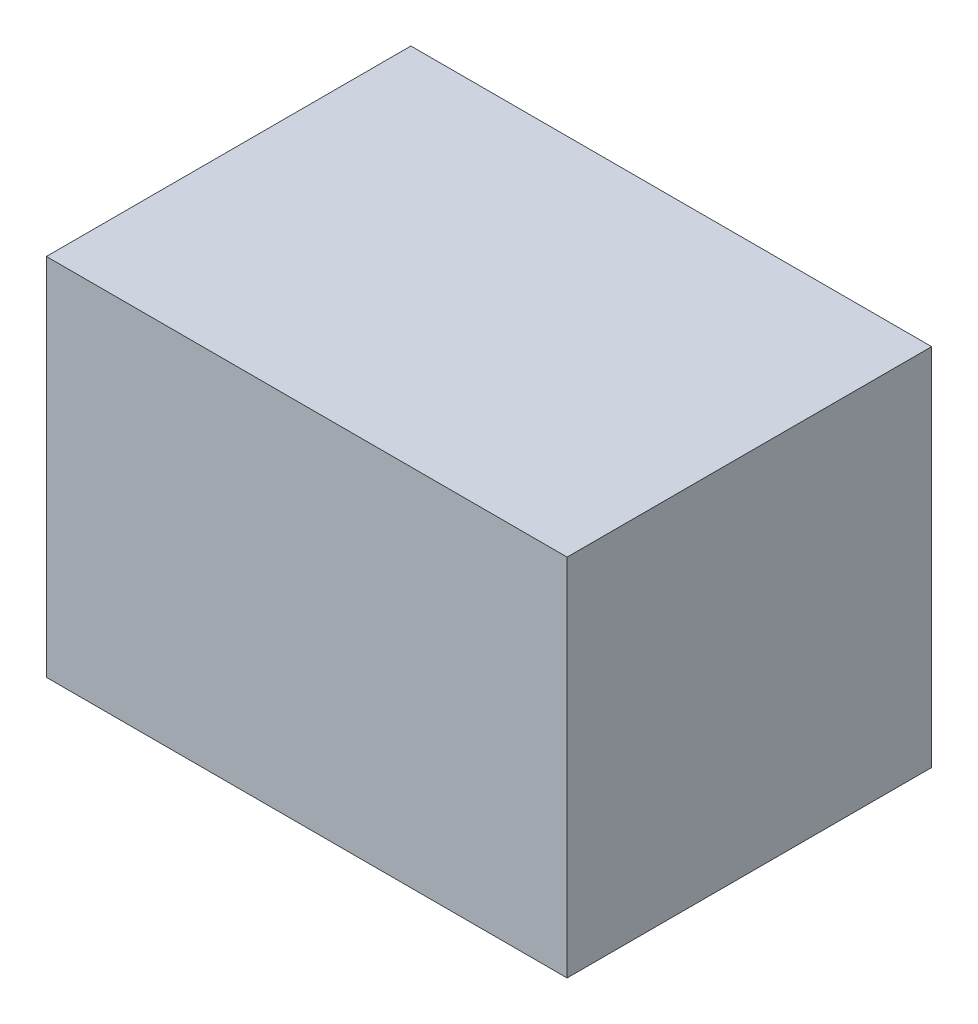
ISO-10303-21;
HEADER;
FILE_DESCRIPTION(('STEP AP214'),'2;1');
FILE_NAME('part.step','',(''),(''),'','','');
FILE_SCHEMA(('AUTOMOTIVE_DESIGN { 1 0 10303 214 1 1 1 1 }'));
ENDSEC;
DATA;
#1=APPLICATION_CONTEXT('core data for automotive mechanical design processes');
#2=APPLICATION_PROTOCOL_DEFINITION('international standard','automotive_design',2000,#1);
#3=PRODUCT_CONTEXT('',#1,'mechanical');
#4=PRODUCT('Part','Part','',(#3));
#5=PRODUCT_RELATED_PRODUCT_CATEGORY('part','',(#4));
#6=PRODUCT_DEFINITION_FORMATION('','',#4);
#7=PRODUCT_DEFINITION_CONTEXT('part definition',#1,'design');
#8=PRODUCT_DEFINITION('design','',#6,#7);
#9=PRODUCT_DEFINITION_SHAPE('','',#8);
#10=(LENGTH_UNIT() NAMED_UNIT(*) SI_UNIT(.MILLI.,.METRE.));
#11=(NAMED_UNIT(*) PLANE_ANGLE_UNIT() SI_UNIT($,.RADIAN.));
#12=(NAMED_UNIT(*) SI_UNIT($,.STERADIAN.) SOLID_ANGLE_UNIT());
#13=UNCERTAINTY_MEASURE_WITH_UNIT(LENGTH_MEASURE(1.E-05),#10,'distance_accuracy_value','');
#14=(GEOMETRIC_REPRESENTATION_CONTEXT(3) GLOBAL_UNCERTAINTY_ASSIGNED_CONTEXT((#13)) GLOBAL_UNIT_ASSIGNED_CONTEXT((#10,
#11,#12)) REPRESENTATION_CONTEXT('',''));
#15=CARTESIAN_POINT('',(0.,0.,0.));
#16=DIRECTION('',(0.,0.,1.));
#17=DIRECTION('',(1.,0.,0.));
#18=AXIS2_PLACEMENT_3D('',#15,#16,#17);
#19=CARTESIAN_POINT('',(-17.78,0.,0.));
#20=DIRECTION('',(0.,1.,0.));
#21=DIRECTION('',(1.,0.,0.));
#22=AXIS2_PLACEMENT_3D('',#19,#20,#21);
#23=PLANE('',#22);
#24=DIRECTION('',(0.,0.,1.));
#25=VECTOR('',#24,1.);
#26=CARTESIAN_POINT('',(-2.79,0.,0.749999999999982));
#27=LINE('',#26,#25);
#28=CARTESIAN_POINT('',(-2.79,0.,0.749999999999982));
#29=VERTEX_POINT('',#28);
#30=CARTESIAN_POINT('',(-2.79,0.,1.1));
#31=VERTEX_POINT('',#30);
#32=EDGE_CURVE('E21',#29,#31,#27,.T.);
#33=ORIENTED_EDGE('',*,*,#32,.T.);
#34=DIRECTION('',(1.,0.,0.));
#35=VECTOR('',#34,1.);
#36=CARTESIAN_POINT('',(-2.79,0.,1.1));
#37=LINE('',#36,#35);
#38=CARTESIAN_POINT('',(-2.29,0.,1.1));
#39=VERTEX_POINT('',#38);
#40=EDGE_CURVE('E28',#31,#39,#37,.T.);
#41=ORIENTED_EDGE('',*,*,#40,.T.);
#42=DIRECTION('',(0.,0.,1.));
#43=VECTOR('',#42,1.);
#44=CARTESIAN_POINT('',(-2.29,0.,0.749999999999982));
#45=LINE('',#44,#43);
#46=CARTESIAN_POINT('',(-2.29,0.,0.749999999999982));
#47=VERTEX_POINT('',#46);
#48=EDGE_CURVE('E67',#47,#39,#45,.T.);
#49=ORIENTED_EDGE('',*,*,#48,.F.);
#50=DIRECTION('',(1.,0.,0.));
#51=VECTOR('',#50,1.);
#52=CARTESIAN_POINT('',(-2.79,0.,0.749999999999982));
#53=LINE('',#52,#51);
#54=EDGE_CURVE('E71',#29,#47,#53,.T.);
#55=ORIENTED_EDGE('',*,*,#54,.F.);
#56=EDGE_LOOP('',(#33,#41,#49,#55));
#57=FACE_BOUND('',#56,.T.);
#58=ADVANCED_FACE('F17',(#57),#23,.T.);
#59=CARTESIAN_POINT('',(-17.78,-0.35,0.));
#60=DIRECTION('',(0.,1.,0.));
#61=DIRECTION('',(1.,0.,0.));
#62=AXIS2_PLACEMENT_3D('',#59,#60,#61);
#63=PLANE('',#62);
#64=DIRECTION('',(0.,0.,1.));
#65=VECTOR('',#64,1.);
#66=CARTESIAN_POINT('',(-2.79,-0.35,0.749999999999982));
#67=LINE('',#66,#65);
#68=CARTESIAN_POINT('',(-2.79,-0.35,0.749999999999982));
#69=VERTEX_POINT('',#68);
#70=CARTESIAN_POINT('',(-2.79,-0.35,1.1));
#71=VERTEX_POINT('',#70);
#72=EDGE_CURVE('E100',#69,#71,#67,.T.);
#73=ORIENTED_EDGE('',*,*,#72,.F.);
#74=DIRECTION('',(1.,0.,0.));
#75=VECTOR('',#74,1.);
#76=CARTESIAN_POINT('',(-2.79,-0.35,0.749999999999982));
#77=LINE('',#76,#75);
#78=CARTESIAN_POINT('',(-2.29,-0.35,0.749999999999982));
#79=VERTEX_POINT('',#78);
#80=EDGE_CURVE('E78',#69,#79,#77,.T.);
#81=ORIENTED_EDGE('',*,*,#80,.T.);
#82=DIRECTION('',(0.,0.,1.));
#83=VECTOR('',#82,1.);
#84=CARTESIAN_POINT('',(-2.29,-0.35,0.749999999999982));
#85=LINE('',#84,#83);
#86=CARTESIAN_POINT('',(-2.29,-0.35,1.1));
#87=VERTEX_POINT('',#86);
#88=EDGE_CURVE('E83',#79,#87,#85,.T.);
#89=ORIENTED_EDGE('',*,*,#88,.T.);
#90=DIRECTION('',(1.,0.,0.));
#91=VECTOR('',#90,1.);
#92=CARTESIAN_POINT('',(-2.79,-0.35,1.1));
#93=LINE('',#92,#91);
#94=EDGE_CURVE('E11',#71,#87,#93,.T.);
#95=ORIENTED_EDGE('',*,*,#94,.F.);
#96=EDGE_LOOP('',(#73,#81,#89,#95));
#97=FACE_BOUND('',#96,.T.);
#98=ADVANCED_FACE('F121',(#97),#63,.F.);
#99=CARTESIAN_POINT('',(-2.79,-0.35,1.1));
#100=DIRECTION('',(0.,0.,1.));
#101=DIRECTION('',(1.,0.,0.));
#102=AXIS2_PLACEMENT_3D('',#99,#100,#101);
#103=PLANE('',#102);
#104=ORIENTED_EDGE('',*,*,#40,.F.);
#105=DIRECTION('',(0.,1.,0.));
#106=VECTOR('',#105,1.);
#107=CARTESIAN_POINT('',(-2.79,-0.35,1.1));
#108=LINE('',#107,#106);
#109=EDGE_CURVE('E92',#71,#31,#108,.T.);
#110=ORIENTED_EDGE('',*,*,#109,.F.);
#111=ORIENTED_EDGE('',*,*,#94,.T.);
#112=DIRECTION('',(0.,1.,0.));
#113=VECTOR('',#112,1.);
#114=CARTESIAN_POINT('',(-2.29,-0.35,1.1));
#115=LINE('',#114,#113);
#116=EDGE_CURVE('E77',#87,#39,#115,.T.);
#117=ORIENTED_EDGE('',*,*,#116,.T.);
#118=EDGE_LOOP('',(#104,#110,#111,#117));
#119=FACE_BOUND('',#118,.T.);
#120=ADVANCED_FACE('F19',(#119),#103,.T.);
#121=CARTESIAN_POINT('',(-2.29,-0.35,0.749999999999982));
#122=DIRECTION('',(-1.,0.,0.));
#123=DIRECTION('',(0.,0.,1.));
#124=AXIS2_PLACEMENT_3D('',#121,#122,#123);
#125=PLANE('',#124);
#126=ORIENTED_EDGE('',*,*,#48,.T.);
#127=ORIENTED_EDGE('',*,*,#116,.F.);
#128=ORIENTED_EDGE('',*,*,#88,.F.);
#129=DIRECTION('',(0.,1.,0.));
#130=VECTOR('',#129,1.);
#131=CARTESIAN_POINT('',(-2.29,-0.35,0.749999999999982));
#132=LINE('',#131,#130);
#133=EDGE_CURVE('E81',#79,#47,#132,.T.);
#134=ORIENTED_EDGE('',*,*,#133,.T.);
#135=EDGE_LOOP('',(#126,#127,#128,#134));
#136=FACE_BOUND('',#135,.T.);
#137=ADVANCED_FACE('F82',(#136),#125,.F.);
#138=CARTESIAN_POINT('',(-2.79,-0.35,0.749999999999982));
#139=DIRECTION('',(0.,0.,1.));
#140=DIRECTION('',(1.,0.,0.));
#141=AXIS2_PLACEMENT_3D('',#138,#139,#140);
#142=PLANE('',#141);
#143=ORIENTED_EDGE('',*,*,#54,.T.);
#144=ORIENTED_EDGE('',*,*,#133,.F.);
#145=ORIENTED_EDGE('',*,*,#80,.F.);
#146=DIRECTION('',(0.,1.,0.));
#147=VECTOR('',#146,1.);
#148=CARTESIAN_POINT('',(-2.79,-0.35,0.749999999999982));
#149=LINE('',#148,#147);
#150=EDGE_CURVE('E89',#69,#29,#149,.T.);
#151=ORIENTED_EDGE('',*,*,#150,.T.);
#152=EDGE_LOOP('',(#143,#144,#145,#151));
#153=FACE_BOUND('',#152,.T.);
#154=ADVANCED_FACE('F87',(#153),#142,.F.);
#155=CARTESIAN_POINT('',(-2.79,-0.35,0.749999999999982));
#156=DIRECTION('',(-1.,0.,0.));
#157=DIRECTION('',(0.,0.,1.));
#158=AXIS2_PLACEMENT_3D('',#155,#156,#157);
#159=PLANE('',#158);
#160=ORIENTED_EDGE('',*,*,#32,.F.);
#161=ORIENTED_EDGE('',*,*,#150,.F.);
#162=ORIENTED_EDGE('',*,*,#72,.T.);
#163=ORIENTED_EDGE('',*,*,#109,.T.);
#164=EDGE_LOOP('',(#160,#161,#162,#163));
#165=FACE_BOUND('',#164,.T.);
#166=ADVANCED_FACE('F123',(#165),#159,.T.);
#167=CLOSED_SHELL('',(#58,#98,#120,#137,#154,#166));
#168=MANIFOLD_SOLID_BREP('B1',#167);
#169=ADVANCED_BREP_SHAPE_REPRESENTATION('',(#18,#168),#14);
#170=SHAPE_DEFINITION_REPRESENTATION(#9,#169);
ENDSEC;
END-ISO-10303-21;
